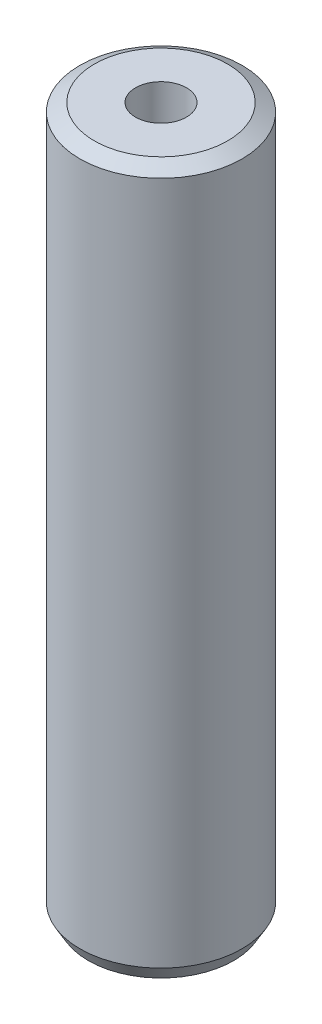
ISO-10303-21;
HEADER;
FILE_DESCRIPTION(('STEP AP214'),'2;1');
FILE_NAME('part.step','',(''),(''),'','','');
FILE_SCHEMA(('AUTOMOTIVE_DESIGN { 1 0 10303 214 1 1 1 1 }'));
ENDSEC;
DATA;
#1=APPLICATION_CONTEXT('core data for automotive mechanical design processes');
#2=APPLICATION_PROTOCOL_DEFINITION('international standard','automotive_design',2000,#1);
#3=PRODUCT_CONTEXT('',#1,'mechanical');
#4=PRODUCT('Part','Part','',(#3));
#5=PRODUCT_RELATED_PRODUCT_CATEGORY('part','',(#4));
#6=PRODUCT_DEFINITION_FORMATION('','',#4);
#7=PRODUCT_DEFINITION_CONTEXT('part definition',#1,'design');
#8=PRODUCT_DEFINITION('design','',#6,#7);
#9=PRODUCT_DEFINITION_SHAPE('','',#8);
#10=(LENGTH_UNIT() NAMED_UNIT(*) SI_UNIT(.MILLI.,.METRE.));
#11=(NAMED_UNIT(*) PLANE_ANGLE_UNIT() SI_UNIT($,.RADIAN.));
#12=(NAMED_UNIT(*) SI_UNIT($,.STERADIAN.) SOLID_ANGLE_UNIT());
#13=UNCERTAINTY_MEASURE_WITH_UNIT(LENGTH_MEASURE(1.E-05),#10,'distance_accuracy_value','');
#14=(GEOMETRIC_REPRESENTATION_CONTEXT(3) GLOBAL_UNCERTAINTY_ASSIGNED_CONTEXT((#13)) GLOBAL_UNIT_ASSIGNED_CONTEXT((#10,
#11,#12)) REPRESENTATION_CONTEXT('',''));
#15=CARTESIAN_POINT('',(0.,0.,0.));
#16=DIRECTION('',(0.,0.,1.));
#17=DIRECTION('',(1.,0.,0.));
#18=AXIS2_PLACEMENT_3D('',#15,#16,#17);
#19=CARTESIAN_POINT('',(0.,239.679760984038,0.));
#20=DIRECTION('',(0.,-1.,0.));
#21=DIRECTION('',(0.,0.,-1.));
#22=AXIS2_PLACEMENT_3D('',#19,#20,#21);
#23=CYLINDRICAL_SURFACE('',#22,27.5);
#24=CARTESIAN_POINT('',(0.,236.84738352763,0.));
#25=DIRECTION('',(0.,1.,0.));
#26=DIRECTION('',(0.,0.,1.));
#27=AXIS2_PLACEMENT_3D('',#24,#25,#26);
#28=CIRCLE('',#27,27.5);
#29=CARTESIAN_POINT('',(0.,236.84738352763,-27.5));
#30=VERTEX_POINT('',#29);
#31=EDGE_CURVE('E50',#30,#30,#28,.F.);
#32=ORIENTED_EDGE('',*,*,#31,.T.);
#33=EDGE_LOOP('',(#32));
#34=FACE_BOUND('',#33,.T.);
#35=CARTESIAN_POINT('',(0.,4.90582166071171,0.));
#36=DIRECTION('',(0.,1.,0.));
#37=DIRECTION('',(0.,0.,1.));
#38=AXIS2_PLACEMENT_3D('',#35,#36,#37);
#39=CIRCLE('',#38,27.5);
#40=CARTESIAN_POINT('',(0.,4.90582166071171,27.5));
#41=VERTEX_POINT('',#40);
#42=EDGE_CURVE('E51',#41,#41,#39,.T.);
#43=ORIENTED_EDGE('',*,*,#42,.T.);
#44=EDGE_LOOP('',(#43));
#45=FACE_BOUND('',#44,.T.);
#46=ADVANCED_FACE('F39',(#34,#45),#23,.T.);
#47=CARTESIAN_POINT('',(0.,239.679760984038,0.));
#48=DIRECTION('',(0.,1.,0.));
#49=DIRECTION('',(0.,0.,1.));
#50=AXIS2_PLACEMENT_3D('',#47,#48,#49);
#51=PLANE('',#50);
#52=CARTESIAN_POINT('',(0.,239.679760984038,0.));
#53=DIRECTION('',(0.,1.,0.));
#54=DIRECTION('',(0.,0.,1.));
#55=AXIS2_PLACEMENT_3D('',#52,#53,#54);
#56=CIRCLE('',#55,22.5941783392883);
#57=CARTESIAN_POINT('',(0.,239.679760984038,-22.5941783392883));
#58=VERTEX_POINT('',#57);
#59=EDGE_CURVE('E54',#58,#58,#56,.T.);
#60=ORIENTED_EDGE('',*,*,#59,.T.);
#61=EDGE_LOOP('',(#60));
#62=FACE_BOUND('',#61,.T.);
#63=CARTESIAN_POINT('',(0.,239.679760984038,0.));
#64=DIRECTION('',(0.,1.,0.));
#65=DIRECTION('',(0.,0.,1.));
#66=AXIS2_PLACEMENT_3D('',#63,#64,#65);
#67=CIRCLE('',#66,8.63863233355218);
#68=CARTESIAN_POINT('',(0.,239.679760984038,8.63863233355218));
#69=VERTEX_POINT('',#68);
#70=EDGE_CURVE('E58',#69,#69,#67,.T.);
#71=ORIENTED_EDGE('',*,*,#70,.F.);
#72=EDGE_LOOP('',(#71));
#73=FACE_BOUND('',#72,.T.);
#74=ADVANCED_FACE('F69',(#62,#73),#51,.T.);
#75=CARTESIAN_POINT('',(0.,0.,0.));
#76=DIRECTION('',(0.,1.,0.));
#77=DIRECTION('',(0.,0.,1.));
#78=AXIS2_PLACEMENT_3D('',#75,#76,#77);
#79=PLANE('',#78);
#80=CARTESIAN_POINT('',(0.,0.,0.));
#81=DIRECTION('',(0.,1.,0.));
#82=DIRECTION('',(0.,0.,1.));
#83=AXIS2_PLACEMENT_3D('',#80,#81,#82);
#84=CIRCLE('',#83,24.6676225435918);
#85=CARTESIAN_POINT('',(0.,0.,24.6676225435918));
#86=VERTEX_POINT('',#85);
#87=EDGE_CURVE('E10',#86,#86,#84,.F.);
#88=ORIENTED_EDGE('',*,*,#87,.T.);
#89=EDGE_LOOP('',(#88));
#90=FACE_BOUND('',#89,.T.);
#91=CARTESIAN_POINT('',(0.,0.,0.));
#92=DIRECTION('',(0.,1.,0.));
#93=DIRECTION('',(0.,0.,1.));
#94=AXIS2_PLACEMENT_3D('',#91,#92,#93);
#95=CIRCLE('',#94,8.63863233355218);
#96=CARTESIAN_POINT('',(0.,0.,8.63863233355218));
#97=VERTEX_POINT('',#96);
#98=EDGE_CURVE('E63',#97,#97,#95,.T.);
#99=ORIENTED_EDGE('',*,*,#98,.T.);
#100=EDGE_LOOP('',(#99));
#101=FACE_BOUND('',#100,.T.);
#102=ADVANCED_FACE('F75',(#90,#101),#79,.F.);
#103=CARTESIAN_POINT('',(0.,239.679760984038,0.));
#104=DIRECTION('',(0.,-1.,0.));
#105=DIRECTION('',(0.,0.,-1.));
#106=AXIS2_PLACEMENT_3D('',#103,#104,#105);
#107=CYLINDRICAL_SURFACE('',#106,8.63863233355218);
#108=ORIENTED_EDGE('',*,*,#70,.T.);
#109=EDGE_LOOP('',(#108));
#110=FACE_BOUND('',#109,.T.);
#111=ORIENTED_EDGE('',*,*,#98,.F.);
#112=EDGE_LOOP('',(#111));
#113=FACE_BOUND('',#112,.T.);
#114=ADVANCED_FACE('F70',(#110,#113),#107,.F.);
#115=CARTESIAN_POINT('',(0.,239.679760984038,0.));
#116=DIRECTION('',(0.,-1.,0.));
#117=DIRECTION('',(0.,0.,-1.));
#118=AXIS2_PLACEMENT_3D('',#115,#116,#117);
#119=CONICAL_SURFACE('',#118,22.5941783392883,1.0471975511966);
#120=CARTESIAN_POINT('',(0.,236.84738352763,-27.5));
#121=CARTESIAN_POINT('',(0.,236.876887459468,-27.4488976910343));
#122=CARTESIAN_POINT('',(0.,236.906391391305,-27.3977953820685));
#123=CARTESIAN_POINT('',(0.,236.96539925498,-27.295590764137));
#124=CARTESIAN_POINT('',(0.,236.994903186818,-27.2444884551713));
#125=CARTESIAN_POINT('',(0.,237.053911050493,-27.1422838372398));
#126=CARTESIAN_POINT('',(0.,237.083414982331,-27.091181528274));
#127=CARTESIAN_POINT('',(0.,237.142422846006,-26.9889769103426));
#128=CARTESIAN_POINT('',(0.,237.171926777843,-26.9378746013768));
#129=CARTESIAN_POINT('',(0.,237.230934641519,-26.8356699834453));
#130=CARTESIAN_POINT('',(0.,237.260438573356,-26.7845676744796));
#131=CARTESIAN_POINT('',(0.,237.319446437031,-26.6823630565481));
#132=CARTESIAN_POINT('',(0.,237.348950368869,-26.6312607475823));
#133=CARTESIAN_POINT('',(0.,237.407958232544,-26.5290561296508));
#134=CARTESIAN_POINT('',(0.,237.437462164382,-26.4779538206851));
#135=CARTESIAN_POINT('',(0.,237.496470028057,-26.3757492027536));
#136=CARTESIAN_POINT('',(0.,237.525973959894,-26.3246468937878));
#137=CARTESIAN_POINT('',(0.,237.58498182357,-26.2224422758563));
#138=CARTESIAN_POINT('',(0.,237.614485755407,-26.1713399668906));
#139=CARTESIAN_POINT('',(0.,237.673493619082,-26.0691353489591));
#140=CARTESIAN_POINT('',(0.,237.70299755092,-26.0180330399934));
#141=CARTESIAN_POINT('',(0.,237.762005414595,-25.9158284220619));
#142=CARTESIAN_POINT('',(0.,237.791509346433,-25.8647261130961));
#143=CARTESIAN_POINT('',(0.,237.850517210108,-25.7625214951646));
#144=CARTESIAN_POINT('',(0.,237.880021141945,-25.7114191861989));
#145=CARTESIAN_POINT('',(0.,237.939029005621,-25.6092145682674));
#146=CARTESIAN_POINT('',(0.,237.968532937458,-25.5581122593016));
#147=CARTESIAN_POINT('',(0.,238.027540801133,-25.4559076413701));
#148=CARTESIAN_POINT('',(0.,238.057044732971,-25.4048053324044));
#149=CARTESIAN_POINT('',(0.,238.116052596646,-25.3026007144729));
#150=CARTESIAN_POINT('',(0.,238.145556528484,-25.2514984055072));
#151=CARTESIAN_POINT('',(0.,238.204564392159,-25.1492937875757));
#152=CARTESIAN_POINT('',(0.,238.234068323996,-25.0981914786099));
#153=CARTESIAN_POINT('',(0.,238.293076187672,-24.9959868606784));
#154=CARTESIAN_POINT('',(0.,238.322580119509,-24.9448845517127));
#155=CARTESIAN_POINT('',(0.,238.381587983184,-24.8426799337812));
#156=CARTESIAN_POINT('',(0.,238.411091915022,-24.7915776248154));
#157=CARTESIAN_POINT('',(0.,238.470099778697,-24.6893730068839));
#158=CARTESIAN_POINT('',(0.,238.499603710535,-24.6382706979182));
#159=CARTESIAN_POINT('',(0.,238.55861157421,-24.5360660799867));
#160=CARTESIAN_POINT('',(0.,238.588115506048,-24.484963771021));
#161=CARTESIAN_POINT('',(0.,238.647123369723,-24.3827591530895));
#162=CARTESIAN_POINT('',(0.,238.67662730156,-24.3316568441237));
#163=CARTESIAN_POINT('',(0.,238.735635165235,-24.2294522261922));
#164=CARTESIAN_POINT('',(0.,238.765139097073,-24.1783499172265));
#165=CARTESIAN_POINT('',(0.,238.824146960748,-24.076145299295));
#166=CARTESIAN_POINT('',(0.,238.853650892586,-24.0250429903292));
#167=CARTESIAN_POINT('',(0.,238.912658756261,-23.9228383723977));
#168=CARTESIAN_POINT('',(0.,238.942162688099,-23.871736063432));
#169=CARTESIAN_POINT('',(0.,239.001170551774,-23.7695314455005));
#170=CARTESIAN_POINT('',(0.,239.030674483611,-23.7184291365347));
#171=CARTESIAN_POINT('',(0.,239.089682347286,-23.6162245186032));
#172=CARTESIAN_POINT('',(0.,239.119186279124,-23.5651222096375));
#173=CARTESIAN_POINT('',(0.,239.178194142799,-23.462917591706));
#174=CARTESIAN_POINT('',(0.,239.207698074637,-23.4118152827403));
#175=CARTESIAN_POINT('',(0.,239.266705938312,-23.3096106648088));
#176=CARTESIAN_POINT('',(0.,239.29620987015,-23.258508355843));
#177=CARTESIAN_POINT('',(0.,239.355217733825,-23.1563037379115));
#178=CARTESIAN_POINT('',(0.,239.384721665662,-23.1052014289458));
#179=CARTESIAN_POINT('',(0.,239.443729529338,-23.0029968110143));
#180=CARTESIAN_POINT('',(0.,239.473233461175,-22.9518945020485));
#181=CARTESIAN_POINT('',(0.,239.53224132485,-22.849689884117));
#182=CARTESIAN_POINT('',(0.,239.561745256688,-22.7985875751513));
#183=CARTESIAN_POINT('',(0.,239.620753120363,-22.6963829572198));
#184=CARTESIAN_POINT('',(0.,239.650257052201,-22.645280648254));
#185=CARTESIAN_POINT('',(0.,239.679760984038,-22.5941783392883));
#186=B_SPLINE_CURVE_WITH_KNOTS('',3,(#120,#121,#122,#123,#124,#125,#126,#127,#128,#129,#130,
#131,#132,#133,#134,#135,#136,#137,#138,#139,#140,#141,#142,#143,#144,#145,#146,#147,#148,#149,
#150,#151,#152,#153,#154,#155,#156,#157,#158,#159,#160,#161,#162,#163,#164,#165,#166,#167,#168,
#169,#170,#171,#172,#173,#174,#175,#176,#177,#178,#179,#180,#181,#182,#183,#184,#185),
.UNSPECIFIED.,.F.,.F.,(4,2,2,2,2,2,2,2,2,2,2,2,2,2,2,2,2,2,2,2,2,2,2,2,2,2,2,2,2,2,2,2,4),(0.,
0.177023591025511,0.354047182051023,0.531070773076534,0.708094364102043,0.885117955127557,
1.06214154615307,1.23916513717859,1.4161887282041,1.59321231922961,1.77023591025513,
1.94725950128063,2.12428309230615,2.30130668333167,2.47833027435718,2.65535386538269,
2.83237745640821,3.00940104743372,3.18642463845923,3.36344822948474,3.54047182051026,
3.71749541153577,3.89451900256129,4.07154259358679,4.24856618461231,4.42558977563782,
4.60261336666334,4.77963695768885,4.95666054871437,5.13368413973988,5.31070773076539,
5.4877313217909,5.66475491281642),.UNSPECIFIED.);
#187=EDGE_CURVE('BSEAM81',#30,#58,#186,.T.);
#188=ORIENTED_EDGE('',*,*,#31,.F.);
#189=ORIENTED_EDGE('',*,*,#59,.F.);
#190=ORIENTED_EDGE('',*,*,#187,.T.);
#191=ORIENTED_EDGE('',*,*,#187,.F.);
#192=EDGE_LOOP('',(#188,#190,#189,#191));
#193=FACE_BOUND('',#192,.T.);
#194=ADVANCED_FACE('F81',(#193),#119,.T.);
#195=CARTESIAN_POINT('',(0.,4.90582166071171,0.));
#196=DIRECTION('',(0.,1.,0.));
#197=DIRECTION('',(0.,0.,1.));
#198=AXIS2_PLACEMENT_3D('',#195,#196,#197);
#199=CONICAL_SURFACE('',#198,27.5,0.523598775598301);
#200=ORIENTED_EDGE('',*,*,#87,.F.);
#201=EDGE_LOOP('',(#200));
#202=FACE_BOUND('',#201,.T.);
#203=ORIENTED_EDGE('',*,*,#42,.F.);
#204=EDGE_LOOP('',(#203));
#205=FACE_BOUND('',#204,.T.);
#206=ADVANCED_FACE('F45',(#202,#205),#199,.T.);
#207=CLOSED_SHELL('',(#46,#74,#102,#114,#194,#206));
#208=MANIFOLD_SOLID_BREP('B2',#207);
#209=ADVANCED_BREP_SHAPE_REPRESENTATION('',(#18,#208),#14);
#210=SHAPE_DEFINITION_REPRESENTATION(#9,#209);
ENDSEC;
END-ISO-10303-21;
